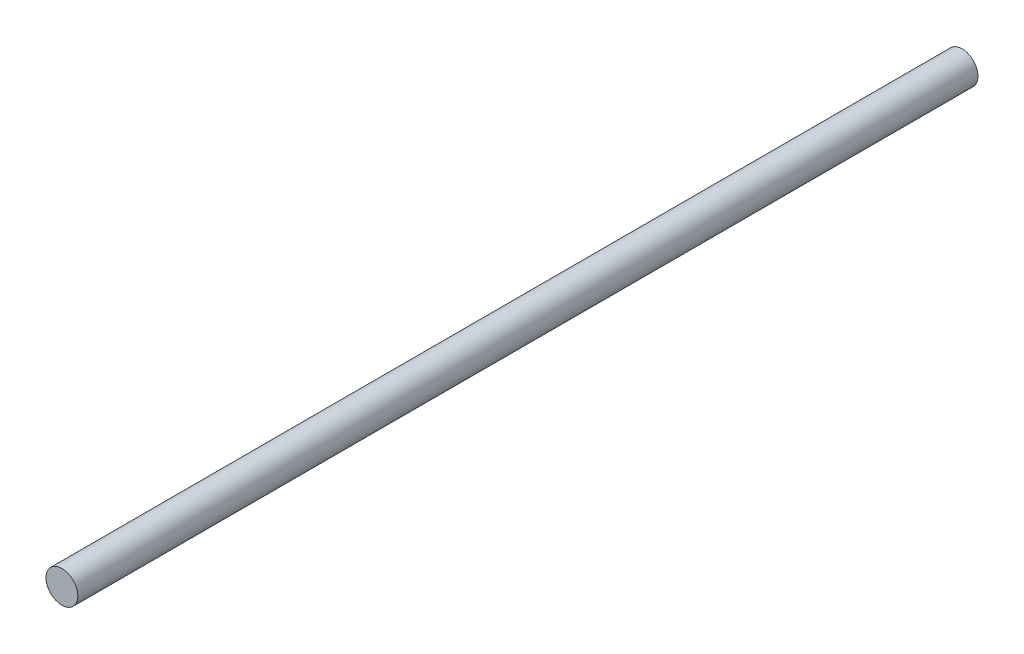
ISO-10303-21;
HEADER;
FILE_DESCRIPTION(('STEP AP214'),'2;1');
FILE_NAME('part.step','',(''),(''),'','','');
FILE_SCHEMA(('AUTOMOTIVE_DESIGN { 1 0 10303 214 1 1 1 1 }'));
ENDSEC;
DATA;
#1=APPLICATION_CONTEXT('core data for automotive mechanical design processes');
#2=APPLICATION_PROTOCOL_DEFINITION('international standard','automotive_design',2000,#1);
#3=PRODUCT_CONTEXT('',#1,'mechanical');
#4=PRODUCT('Part','Part','',(#3));
#5=PRODUCT_RELATED_PRODUCT_CATEGORY('part','',(#4));
#6=PRODUCT_DEFINITION_FORMATION('','',#4);
#7=PRODUCT_DEFINITION_CONTEXT('part definition',#1,'design');
#8=PRODUCT_DEFINITION('design','',#6,#7);
#9=PRODUCT_DEFINITION_SHAPE('','',#8);
#10=(LENGTH_UNIT() NAMED_UNIT(*) SI_UNIT(.MILLI.,.METRE.));
#11=(NAMED_UNIT(*) PLANE_ANGLE_UNIT() SI_UNIT($,.RADIAN.));
#12=(NAMED_UNIT(*) SI_UNIT($,.STERADIAN.) SOLID_ANGLE_UNIT());
#13=UNCERTAINTY_MEASURE_WITH_UNIT(LENGTH_MEASURE(1.E-05),#10,'distance_accuracy_value','');
#14=(GEOMETRIC_REPRESENTATION_CONTEXT(3) GLOBAL_UNCERTAINTY_ASSIGNED_CONTEXT((#13)) GLOBAL_UNIT_ASSIGNED_CONTEXT((#10,
#11,#12)) REPRESENTATION_CONTEXT('',''));
#15=CARTESIAN_POINT('',(0.,0.,0.));
#16=DIRECTION('',(0.,0.,1.));
#17=DIRECTION('',(1.,0.,0.));
#18=AXIS2_PLACEMENT_3D('',#15,#16,#17);
#19=CARTESIAN_POINT('',(0.,0.,367.475));
#20=DIRECTION('',(0.,0.,-1.));
#21=DIRECTION('',(-1.,0.,0.));
#22=AXIS2_PLACEMENT_3D('',#19,#20,#21);
#23=CYLINDRICAL_SURFACE('',#22,6.5);
#24=CARTESIAN_POINT('',(0.,0.,367.475));
#25=DIRECTION('',(0.,0.,1.));
#26=DIRECTION('',(1.,0.,0.));
#27=AXIS2_PLACEMENT_3D('',#24,#25,#26);
#28=CIRCLE('',#27,6.5);
#29=CARTESIAN_POINT('',(6.5,0.,367.475));
#30=VERTEX_POINT('',#29);
#31=EDGE_CURVE('E10',#30,#30,#28,.T.);
#32=ORIENTED_EDGE('',*,*,#31,.F.);
#33=EDGE_LOOP('',(#32));
#34=FACE_BOUND('',#33,.T.);
#35=CARTESIAN_POINT('',(0.,0.,0.));
#36=DIRECTION('',(0.,0.,1.));
#37=DIRECTION('',(1.,0.,0.));
#38=AXIS2_PLACEMENT_3D('',#35,#36,#37);
#39=CIRCLE('',#38,6.5);
#40=CARTESIAN_POINT('',(6.5,0.,0.));
#41=VERTEX_POINT('',#40);
#42=EDGE_CURVE('E34',#41,#41,#39,.T.);
#43=ORIENTED_EDGE('',*,*,#42,.T.);
#44=EDGE_LOOP('',(#43));
#45=FACE_BOUND('',#44,.T.);
#46=ADVANCED_FACE('F31',(#34,#45),#23,.T.);
#47=CARTESIAN_POINT('',(0.,0.,367.475));
#48=DIRECTION('',(0.,0.,1.));
#49=DIRECTION('',(1.,0.,0.));
#50=AXIS2_PLACEMENT_3D('',#47,#48,#49);
#51=PLANE('',#50);
#52=ORIENTED_EDGE('',*,*,#31,.T.);
#53=EDGE_LOOP('',(#52));
#54=FACE_BOUND('',#53,.T.);
#55=ADVANCED_FACE('F46',(#54),#51,.T.);
#56=CARTESIAN_POINT('',(0.,0.,0.));
#57=DIRECTION('',(0.,0.,1.));
#58=DIRECTION('',(1.,0.,0.));
#59=AXIS2_PLACEMENT_3D('',#56,#57,#58);
#60=PLANE('',#59);
#61=ORIENTED_EDGE('',*,*,#42,.F.);
#62=EDGE_LOOP('',(#61));
#63=FACE_BOUND('',#62,.T.);
#64=ADVANCED_FACE('F44',(#63),#60,.F.);
#65=CLOSED_SHELL('',(#46,#55,#64));
#66=MANIFOLD_SOLID_BREP('B2',#65);
#67=ADVANCED_BREP_SHAPE_REPRESENTATION('',(#18,#66),#14);
#68=SHAPE_DEFINITION_REPRESENTATION(#9,#67);
ENDSEC;
END-ISO-10303-21;
